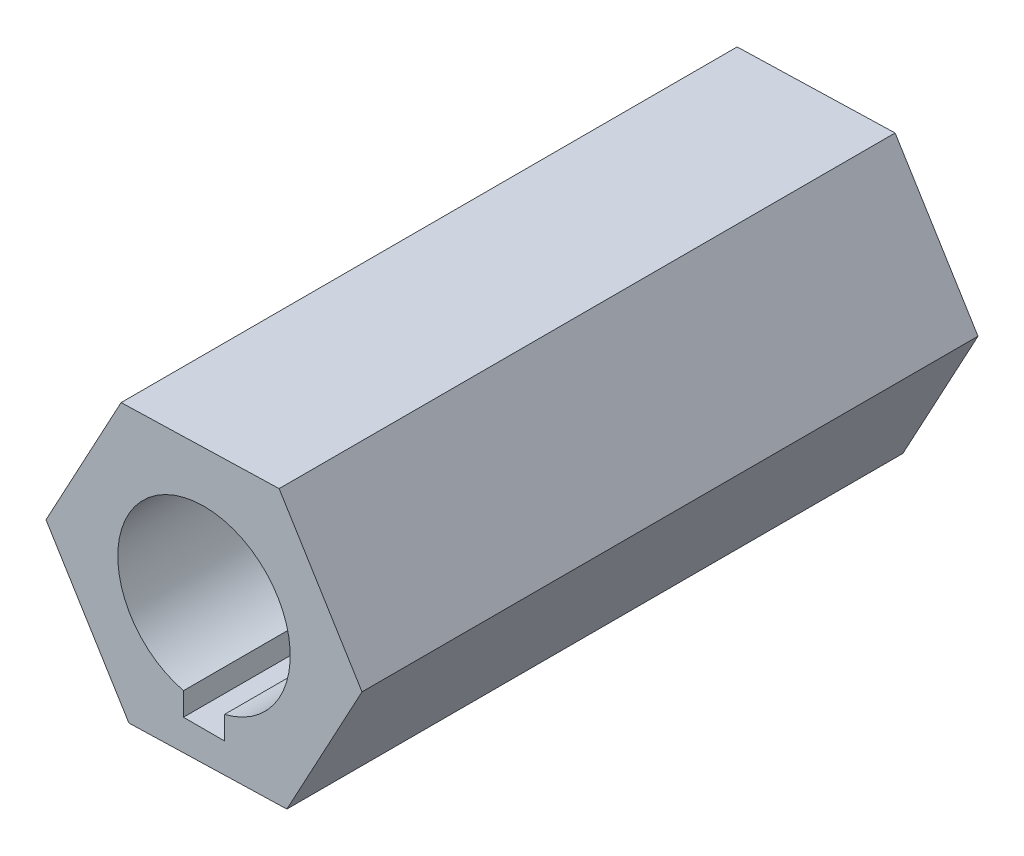
ISO-10303-21;
HEADER;
FILE_DESCRIPTION(('STEP AP214'),'2;1');
FILE_NAME('part.step','',(''),(''),'','','');
FILE_SCHEMA(('AUTOMOTIVE_DESIGN { 1 0 10303 214 1 1 1 1 }'));
ENDSEC;
DATA;
#1=APPLICATION_CONTEXT('core data for automotive mechanical design processes');
#2=APPLICATION_PROTOCOL_DEFINITION('international standard','automotive_design',2000,#1);
#3=PRODUCT_CONTEXT('',#1,'mechanical');
#4=PRODUCT('Part','Part','',(#3));
#5=PRODUCT_RELATED_PRODUCT_CATEGORY('part','',(#4));
#6=PRODUCT_DEFINITION_FORMATION('','',#4);
#7=PRODUCT_DEFINITION_CONTEXT('part definition',#1,'design');
#8=PRODUCT_DEFINITION('design','',#6,#7);
#9=PRODUCT_DEFINITION_SHAPE('','',#8);
#10=(LENGTH_UNIT() NAMED_UNIT(*) SI_UNIT(.MILLI.,.METRE.));
#11=(NAMED_UNIT(*) PLANE_ANGLE_UNIT() SI_UNIT($,.RADIAN.));
#12=(NAMED_UNIT(*) SI_UNIT($,.STERADIAN.) SOLID_ANGLE_UNIT());
#13=UNCERTAINTY_MEASURE_WITH_UNIT(LENGTH_MEASURE(1.E-05),#10,'distance_accuracy_value','');
#14=(GEOMETRIC_REPRESENTATION_CONTEXT(3) GLOBAL_UNCERTAINTY_ASSIGNED_CONTEXT((#13)) GLOBAL_UNIT_ASSIGNED_CONTEXT((#10,
#11,#12)) REPRESENTATION_CONTEXT('',''));
#15=CARTESIAN_POINT('',(0.,0.,0.));
#16=DIRECTION('',(0.,0.,1.));
#17=DIRECTION('',(1.,0.,0.));
#18=AXIS2_PLACEMENT_3D('',#15,#16,#17);
#19=CARTESIAN_POINT('',(0.,0.,28.575));
#20=DIRECTION('',(0.,0.,1.));
#21=DIRECTION('',(1.,0.,0.));
#22=AXIS2_PLACEMENT_3D('',#19,#20,#21);
#23=PLANE('',#22);
#24=DIRECTION('',(0.,1.,0.));
#25=VECTOR('',#24,1.);
#26=CARTESIAN_POINT('',(0.9525,-3.0475,28.575));
#27=LINE('',#26,#25);
#28=CARTESIAN_POINT('',(0.9525,-4.9525,28.575));
#29=VERTEX_POINT('',#28);
#30=CARTESIAN_POINT('',(0.9525,-3.88493806256934,28.575));
#31=VERTEX_POINT('',#30);
#32=EDGE_CURVE('E167',#29,#31,#27,.T.);
#33=ORIENTED_EDGE('',*,*,#32,.F.);
#34=DIRECTION('',(1.,0.,0.));
#35=VECTOR('',#34,1.);
#36=CARTESIAN_POINT('',(-0.9525,-4.9525,28.575));
#37=LINE('',#36,#35);
#38=CARTESIAN_POINT('',(-0.9525,-4.9525,28.575));
#39=VERTEX_POINT('',#38);
#40=EDGE_CURVE('E166',#39,#29,#37,.T.);
#41=ORIENTED_EDGE('',*,*,#40,.F.);
#42=DIRECTION('',(0.,-1.,0.));
#43=VECTOR('',#42,1.);
#44=CARTESIAN_POINT('',(-0.9525,-3.0475,28.575));
#45=LINE('',#44,#43);
#46=CARTESIAN_POINT('',(-0.9525,-3.88493806256934,28.575));
#47=VERTEX_POINT('',#46);
#48=EDGE_CURVE('E154',#47,#39,#45,.T.);
#49=ORIENTED_EDGE('',*,*,#48,.F.);
#50=CARTESIAN_POINT('',(0.,0.,28.575));
#51=DIRECTION('',(0.,0.,1.));
#52=DIRECTION('',(1.,0.,0.));
#53=AXIS2_PLACEMENT_3D('',#50,#51,#52);
#54=CIRCLE('',#53,4.);
#55=EDGE_CURVE('E133',#31,#47,#54,.T.);
#56=ORIENTED_EDGE('',*,*,#55,.F.);
#57=EDGE_LOOP('',(#33,#41,#49,#56));
#58=FACE_BOUND('',#57,.T.);
#59=DIRECTION('',(-0.475265950894514,-0.87984218807712,0.));
#60=VECTOR('',#59,1.);
#61=CARTESIAN_POINT('',(-3.84459012253608,6.2435935264102,28.575));
#62=LINE('',#61,#60);
#63=CARTESIAN_POINT('',(-3.84459012253608,6.2435935264102,28.575));
#64=VERTEX_POINT('',#63);
#65=CARTESIAN_POINT('',(-7.32940566604334,-0.207715950049871,28.575));
#66=VERTEX_POINT('',#65);
#67=EDGE_CURVE('E141',#64,#66,#62,.T.);
#68=ORIENTED_EDGE('',*,*,#67,.T.);
#69=DIRECTION('',(0.524332710748814,-0.851513481066976,0.));
#70=VECTOR('',#69,1.);
#71=CARTESIAN_POINT('',(-7.32940566604334,-0.207715950049871,28.575));
#72=LINE('',#71,#70);
#73=CARTESIAN_POINT('',(-3.48481554350726,-6.45130947646007,28.575));
#74=VERTEX_POINT('',#73);
#75=EDGE_CURVE('E93',#66,#74,#72,.T.);
#76=ORIENTED_EDGE('',*,*,#75,.T.);
#77=DIRECTION('',(0.999598661643328,0.0283287070101433,0.));
#78=VECTOR('',#77,1.);
#79=CARTESIAN_POINT('',(-3.48481554350726,-6.45130947646007,28.575));
#80=LINE('',#79,#78);
#81=CARTESIAN_POINT('',(3.84459012253608,-6.2435935264102,28.575));
#82=VERTEX_POINT('',#81);
#83=EDGE_CURVE('E108',#74,#82,#80,.T.);
#84=ORIENTED_EDGE('',*,*,#83,.T.);
#85=DIRECTION('',(0.475265950894514,0.87984218807712,0.));
#86=VECTOR('',#85,1.);
#87=CARTESIAN_POINT('',(3.84459012253608,-6.2435935264102,28.575));
#88=LINE('',#87,#86);
#89=CARTESIAN_POINT('',(7.32940566604334,0.207715950049875,28.575));
#90=VERTEX_POINT('',#89);
#91=EDGE_CURVE('E102',#82,#90,#88,.T.);
#92=ORIENTED_EDGE('',*,*,#91,.T.);
#93=DIRECTION('',(-0.524332710748814,0.851513481066976,0.));
#94=VECTOR('',#93,1.);
#95=CARTESIAN_POINT('',(7.32940566604334,0.207715950049875,28.575));
#96=LINE('',#95,#94);
#97=CARTESIAN_POINT('',(3.48481554350726,6.45130947646007,28.575));
#98=VERTEX_POINT('',#97);
#99=EDGE_CURVE('E105',#90,#98,#96,.T.);
#100=ORIENTED_EDGE('',*,*,#99,.T.);
#101=DIRECTION('',(-0.999598661643329,-0.0283287070101432,0.));
#102=VECTOR('',#101,1.);
#103=CARTESIAN_POINT('',(3.48481554350726,6.45130947646007,28.575));
#104=LINE('',#103,#102);
#105=EDGE_CURVE('E57',#98,#64,#104,.T.);
#106=ORIENTED_EDGE('',*,*,#105,.T.);
#107=EDGE_LOOP('',(#68,#76,#84,#92,#100,#106));
#108=FACE_BOUND('',#107,.T.);
#109=ADVANCED_FACE('F33',(#58,#108),#23,.T.);
#110=CARTESIAN_POINT('',(0.,0.,0.));
#111=DIRECTION('',(0.,0.,1.));
#112=DIRECTION('',(1.,0.,0.));
#113=AXIS2_PLACEMENT_3D('',#110,#111,#112);
#114=PLANE('',#113);
#115=DIRECTION('',(-0.475265950894514,-0.87984218807712,0.));
#116=VECTOR('',#115,1.);
#117=CARTESIAN_POINT('',(-3.84459012253608,6.2435935264102,0.));
#118=LINE('',#117,#116);
#119=CARTESIAN_POINT('',(-3.84459012253608,6.2435935264102,0.));
#120=VERTEX_POINT('',#119);
#121=CARTESIAN_POINT('',(-7.32940566604334,-0.207715950049871,0.));
#122=VERTEX_POINT('',#121);
#123=EDGE_CURVE('E129',#120,#122,#118,.T.);
#124=ORIENTED_EDGE('',*,*,#123,.F.);
#125=DIRECTION('',(-0.999598661643329,-0.0283287070101432,0.));
#126=VECTOR('',#125,1.);
#127=CARTESIAN_POINT('',(3.48481554350726,6.45130947646007,0.));
#128=LINE('',#127,#126);
#129=CARTESIAN_POINT('',(3.48481554350726,6.45130947646007,0.));
#130=VERTEX_POINT('',#129);
#131=EDGE_CURVE('E84',#130,#120,#128,.T.);
#132=ORIENTED_EDGE('',*,*,#131,.F.);
#133=DIRECTION('',(-0.524332710748814,0.851513481066976,0.));
#134=VECTOR('',#133,1.);
#135=CARTESIAN_POINT('',(7.32940566604334,0.207715950049875,0.));
#136=LINE('',#135,#134);
#137=CARTESIAN_POINT('',(7.32940566604334,0.207715950049875,0.));
#138=VERTEX_POINT('',#137);
#139=EDGE_CURVE('E138',#138,#130,#136,.T.);
#140=ORIENTED_EDGE('',*,*,#139,.F.);
#141=DIRECTION('',(0.475265950894514,0.87984218807712,0.));
#142=VECTOR('',#141,1.);
#143=CARTESIAN_POINT('',(3.84459012253608,-6.2435935264102,0.));
#144=LINE('',#143,#142);
#145=CARTESIAN_POINT('',(3.84459012253608,-6.2435935264102,0.));
#146=VERTEX_POINT('',#145);
#147=EDGE_CURVE('E117',#146,#138,#144,.T.);
#148=ORIENTED_EDGE('',*,*,#147,.F.);
#149=DIRECTION('',(0.999598661643328,0.0283287070101433,0.));
#150=VECTOR('',#149,1.);
#151=CARTESIAN_POINT('',(-3.48481554350726,-6.45130947646007,0.));
#152=LINE('',#151,#150);
#153=CARTESIAN_POINT('',(-3.48481554350726,-6.45130947646007,0.));
#154=VERTEX_POINT('',#153);
#155=EDGE_CURVE('E135',#154,#146,#152,.T.);
#156=ORIENTED_EDGE('',*,*,#155,.F.);
#157=DIRECTION('',(0.524332710748814,-0.851513481066976,0.));
#158=VECTOR('',#157,1.);
#159=CARTESIAN_POINT('',(-7.32940566604334,-0.207715950049871,0.));
#160=LINE('',#159,#158);
#161=EDGE_CURVE('E132',#122,#154,#160,.T.);
#162=ORIENTED_EDGE('',*,*,#161,.F.);
#163=EDGE_LOOP('',(#124,#132,#140,#148,#156,#162));
#164=FACE_BOUND('',#163,.T.);
#165=DIRECTION('',(1.,0.,0.));
#166=VECTOR('',#165,1.);
#167=CARTESIAN_POINT('',(-0.9525,-4.9525,0.));
#168=LINE('',#167,#166);
#169=CARTESIAN_POINT('',(-0.9525,-4.9525,0.));
#170=VERTEX_POINT('',#169);
#171=CARTESIAN_POINT('',(0.9525,-4.9525,0.));
#172=VERTEX_POINT('',#171);
#173=EDGE_CURVE('E303',#170,#172,#168,.T.);
#174=ORIENTED_EDGE('',*,*,#173,.T.);
#175=DIRECTION('',(0.,1.,0.));
#176=VECTOR('',#175,1.);
#177=CARTESIAN_POINT('',(0.9525,-3.0475,0.));
#178=LINE('',#177,#176);
#179=CARTESIAN_POINT('',(0.9525,-3.88493806256934,0.));
#180=VERTEX_POINT('',#179);
#181=EDGE_CURVE('E298',#172,#180,#178,.T.);
#182=ORIENTED_EDGE('',*,*,#181,.T.);
#183=CARTESIAN_POINT('',(0.,0.,0.));
#184=DIRECTION('',(0.,0.,1.));
#185=DIRECTION('',(1.,0.,0.));
#186=AXIS2_PLACEMENT_3D('',#183,#184,#185);
#187=CIRCLE('',#186,4.);
#188=CARTESIAN_POINT('',(-0.9525,-3.88493806256934,0.));
#189=VERTEX_POINT('',#188);
#190=EDGE_CURVE('E171',#180,#189,#187,.T.);
#191=ORIENTED_EDGE('',*,*,#190,.T.);
#192=DIRECTION('',(0.,-1.,0.));
#193=VECTOR('',#192,1.);
#194=CARTESIAN_POINT('',(-0.9525,-3.0475,0.));
#195=LINE('',#194,#193);
#196=EDGE_CURVE('E48',#189,#170,#195,.T.);
#197=ORIENTED_EDGE('',*,*,#196,.T.);
#198=EDGE_LOOP('',(#174,#182,#191,#197));
#199=FACE_BOUND('',#198,.T.);
#200=ADVANCED_FACE('F188',(#164,#199),#114,.F.);
#201=CARTESIAN_POINT('',(-3.84459012253608,6.2435935264102,28.575));
#202=DIRECTION('',(0.879842188077119,-0.475265950894514,0.));
#203=DIRECTION('',(0.475265950894514,0.87984218807712,0.));
#204=AXIS2_PLACEMENT_3D('',#201,#202,#203);
#205=PLANE('',#204);
#206=ORIENTED_EDGE('',*,*,#123,.T.);
#207=DIRECTION('',(0.,0.,-1.));
#208=VECTOR('',#207,1.);
#209=CARTESIAN_POINT('',(-7.32940566604334,-0.207715950049871,28.575));
#210=LINE('',#209,#208);
#211=EDGE_CURVE('E148',#66,#122,#210,.T.);
#212=ORIENTED_EDGE('',*,*,#211,.F.);
#213=ORIENTED_EDGE('',*,*,#67,.F.);
#214=DIRECTION('',(0.,0.,-1.));
#215=VECTOR('',#214,1.);
#216=CARTESIAN_POINT('',(-3.84459012253608,6.2435935264102,28.575));
#217=LINE('',#216,#215);
#218=EDGE_CURVE('E125',#64,#120,#217,.T.);
#219=ORIENTED_EDGE('',*,*,#218,.T.);
#220=EDGE_LOOP('',(#206,#212,#213,#219));
#221=FACE_BOUND('',#220,.T.);
#222=ADVANCED_FACE('F35',(#221),#205,.F.);
#223=CARTESIAN_POINT('',(-7.32940566604334,-0.207715950049871,28.575));
#224=DIRECTION('',(0.851513481066977,0.524332710748814,0.));
#225=DIRECTION('',(-0.524332710748814,0.851513481066977,0.));
#226=AXIS2_PLACEMENT_3D('',#223,#224,#225);
#227=PLANE('',#226);
#228=ORIENTED_EDGE('',*,*,#161,.T.);
#229=DIRECTION('',(0.,0.,-1.));
#230=VECTOR('',#229,1.);
#231=CARTESIAN_POINT('',(-3.48481554350726,-6.45130947646007,28.575));
#232=LINE('',#231,#230);
#233=EDGE_CURVE('E145',#74,#154,#232,.T.);
#234=ORIENTED_EDGE('',*,*,#233,.F.);
#235=ORIENTED_EDGE('',*,*,#75,.F.);
#236=ORIENTED_EDGE('',*,*,#211,.T.);
#237=EDGE_LOOP('',(#228,#234,#235,#236));
#238=FACE_BOUND('',#237,.T.);
#239=ADVANCED_FACE('F182',(#238),#227,.F.);
#240=CARTESIAN_POINT('',(-3.48481554350726,-6.45130947646007,28.575));
#241=DIRECTION('',(-0.0283287070101433,0.999598661643328,0.));
#242=DIRECTION('',(-0.999598661643328,-0.0283287070101433,0.));
#243=AXIS2_PLACEMENT_3D('',#240,#241,#242);
#244=PLANE('',#243);
#245=ORIENTED_EDGE('',*,*,#155,.T.);
#246=DIRECTION('',(0.,0.,-1.));
#247=VECTOR('',#246,1.);
#248=CARTESIAN_POINT('',(3.84459012253608,-6.2435935264102,28.575));
#249=LINE('',#248,#247);
#250=EDGE_CURVE('E120',#82,#146,#249,.T.);
#251=ORIENTED_EDGE('',*,*,#250,.F.);
#252=ORIENTED_EDGE('',*,*,#83,.F.);
#253=ORIENTED_EDGE('',*,*,#233,.T.);
#254=EDGE_LOOP('',(#245,#251,#252,#253));
#255=FACE_BOUND('',#254,.T.);
#256=ADVANCED_FACE('F185',(#255),#244,.F.);
#257=CARTESIAN_POINT('',(3.84459012253608,-6.2435935264102,28.575));
#258=DIRECTION('',(-0.87984218807712,0.475265950894514,0.));
#259=DIRECTION('',(-0.475265950894514,-0.87984218807712,0.));
#260=AXIS2_PLACEMENT_3D('',#257,#258,#259);
#261=PLANE('',#260);
#262=ORIENTED_EDGE('',*,*,#147,.T.);
#263=DIRECTION('',(0.,0.,-1.));
#264=VECTOR('',#263,1.);
#265=CARTESIAN_POINT('',(7.32940566604334,0.207715950049875,28.575));
#266=LINE('',#265,#264);
#267=EDGE_CURVE('E114',#90,#138,#266,.T.);
#268=ORIENTED_EDGE('',*,*,#267,.F.);
#269=ORIENTED_EDGE('',*,*,#91,.F.);
#270=ORIENTED_EDGE('',*,*,#250,.T.);
#271=EDGE_LOOP('',(#262,#268,#269,#270));
#272=FACE_BOUND('',#271,.T.);
#273=ADVANCED_FACE('F115',(#272),#261,.F.);
#274=CARTESIAN_POINT('',(7.32940566604334,0.207715950049875,28.575));
#275=DIRECTION('',(-0.851513481066977,-0.524332710748814,0.));
#276=DIRECTION('',(0.524332710748814,-0.851513481066976,0.));
#277=AXIS2_PLACEMENT_3D('',#274,#275,#276);
#278=PLANE('',#277);
#279=ORIENTED_EDGE('',*,*,#139,.T.);
#280=DIRECTION('',(0.,0.,-1.));
#281=VECTOR('',#280,1.);
#282=CARTESIAN_POINT('',(3.48481554350726,6.45130947646007,28.575));
#283=LINE('',#282,#281);
#284=EDGE_CURVE('E121',#98,#130,#283,.T.);
#285=ORIENTED_EDGE('',*,*,#284,.F.);
#286=ORIENTED_EDGE('',*,*,#99,.F.);
#287=ORIENTED_EDGE('',*,*,#267,.T.);
#288=EDGE_LOOP('',(#279,#285,#286,#287));
#289=FACE_BOUND('',#288,.T.);
#290=ADVANCED_FACE('F123',(#289),#278,.F.);
#291=CARTESIAN_POINT('',(3.48481554350726,6.45130947646007,28.575));
#292=DIRECTION('',(0.0283287070101432,-0.999598661643328,0.));
#293=DIRECTION('',(0.999598661643328,0.0283287070101432,0.));
#294=AXIS2_PLACEMENT_3D('',#291,#292,#293);
#295=PLANE('',#294);
#296=ORIENTED_EDGE('',*,*,#131,.T.);
#297=ORIENTED_EDGE('',*,*,#218,.F.);
#298=ORIENTED_EDGE('',*,*,#105,.F.);
#299=ORIENTED_EDGE('',*,*,#284,.T.);
#300=EDGE_LOOP('',(#296,#297,#298,#299));
#301=FACE_BOUND('',#300,.T.);
#302=ADVANCED_FACE('F190',(#301),#295,.F.);
#303=CARTESIAN_POINT('',(0.,0.,28.575));
#304=DIRECTION('',(0.,0.,-1.));
#305=DIRECTION('',(-1.,0.,0.));
#306=AXIS2_PLACEMENT_3D('',#303,#304,#305);
#307=CYLINDRICAL_SURFACE('',#306,4.);
#308=DIRECTION('',(0.,0.,-1.));
#309=VECTOR('',#308,1.);
#310=CARTESIAN_POINT('',(0.9525,-3.88493806256934,28.575));
#311=LINE('',#310,#309);
#312=EDGE_CURVE('E11',#31,#180,#311,.T.);
#313=ORIENTED_EDGE('',*,*,#312,.F.);
#314=ORIENTED_EDGE('',*,*,#55,.T.);
#315=DIRECTION('',(0.,0.,-1.));
#316=VECTOR('',#315,1.);
#317=CARTESIAN_POINT('',(-0.9525,-3.88493806256934,28.575));
#318=LINE('',#317,#316);
#319=EDGE_CURVE('E41',#189,#47,#318,.F.);
#320=ORIENTED_EDGE('',*,*,#319,.F.);
#321=ORIENTED_EDGE('',*,*,#190,.F.);
#322=EDGE_LOOP('',(#313,#314,#320,#321));
#323=FACE_BOUND('',#322,.T.);
#324=ADVANCED_FACE('F170',(#323),#307,.F.);
#325=CARTESIAN_POINT('',(0.9525,-3.0475,0.));
#326=DIRECTION('',(1.,0.,0.));
#327=DIRECTION('',(0.,1.,0.));
#328=AXIS2_PLACEMENT_3D('',#325,#326,#327);
#329=PLANE('',#328);
#330=ORIENTED_EDGE('',*,*,#312,.T.);
#331=ORIENTED_EDGE('',*,*,#181,.F.);
#332=DIRECTION('',(0.,0.,1.));
#333=VECTOR('',#332,1.);
#334=CARTESIAN_POINT('',(0.9525,-4.9525,0.));
#335=LINE('',#334,#333);
#336=EDGE_CURVE('E173',#172,#29,#335,.T.);
#337=ORIENTED_EDGE('',*,*,#336,.T.);
#338=ORIENTED_EDGE('',*,*,#32,.T.);
#339=EDGE_LOOP('',(#330,#331,#337,#338));
#340=FACE_BOUND('',#339,.T.);
#341=ADVANCED_FACE('F234',(#340),#329,.F.);
#342=CARTESIAN_POINT('',(-0.9525,-4.9525,0.));
#343=DIRECTION('',(0.,-1.,0.));
#344=DIRECTION('',(0.,0.,-1.));
#345=AXIS2_PLACEMENT_3D('',#342,#343,#344);
#346=PLANE('',#345);
#347=ORIENTED_EDGE('',*,*,#40,.T.);
#348=ORIENTED_EDGE('',*,*,#336,.F.);
#349=ORIENTED_EDGE('',*,*,#173,.F.);
#350=DIRECTION('',(0.,0.,1.));
#351=VECTOR('',#350,1.);
#352=CARTESIAN_POINT('',(-0.9525,-4.9525,0.));
#353=LINE('',#352,#351);
#354=EDGE_CURVE('E176',#170,#39,#353,.T.);
#355=ORIENTED_EDGE('',*,*,#354,.T.);
#356=EDGE_LOOP('',(#347,#348,#349,#355));
#357=FACE_BOUND('',#356,.T.);
#358=ADVANCED_FACE('F241',(#357),#346,.F.);
#359=CARTESIAN_POINT('',(-0.9525,-3.0475,0.));
#360=DIRECTION('',(-1.,0.,0.));
#361=DIRECTION('',(0.,-1.,0.));
#362=AXIS2_PLACEMENT_3D('',#359,#360,#361);
#363=PLANE('',#362);
#364=ORIENTED_EDGE('',*,*,#319,.T.);
#365=ORIENTED_EDGE('',*,*,#48,.T.);
#366=ORIENTED_EDGE('',*,*,#354,.F.);
#367=ORIENTED_EDGE('',*,*,#196,.F.);
#368=EDGE_LOOP('',(#364,#365,#366,#367));
#369=FACE_BOUND('',#368,.T.);
#370=ADVANCED_FACE('F152',(#369),#363,.F.);
#371=CLOSED_SHELL('',(#109,#200,#222,#239,#256,#273,#290,#302,#324,#341,#358,#370));
#372=MANIFOLD_SOLID_BREP('B2',#371);
#373=ADVANCED_BREP_SHAPE_REPRESENTATION('',(#18,#372),#14);
#374=SHAPE_DEFINITION_REPRESENTATION(#9,#373);
ENDSEC;
END-ISO-10303-21;
